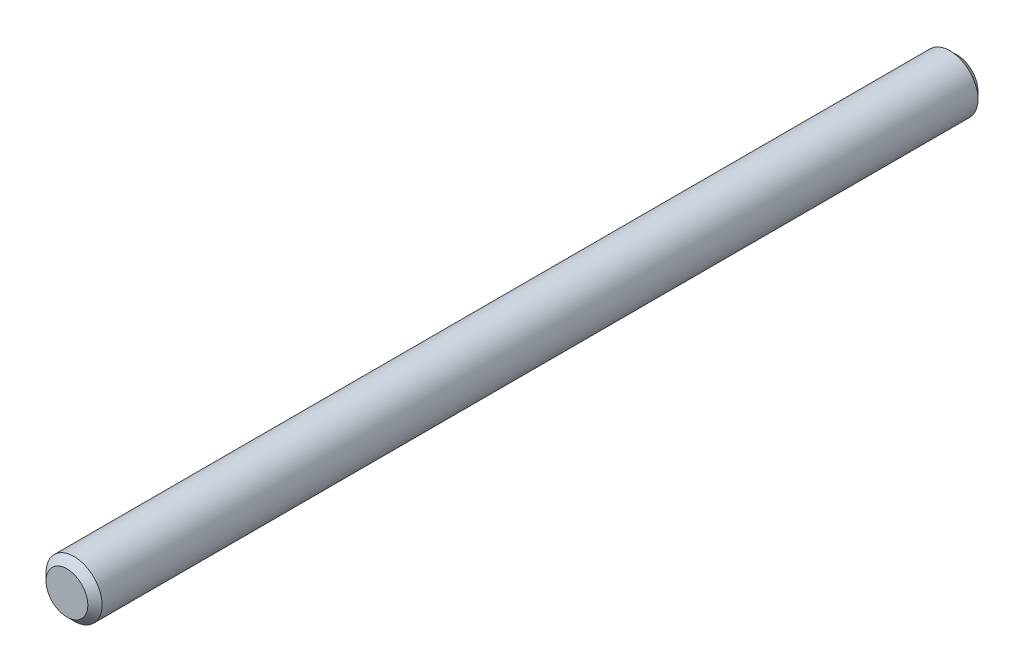
ISO-10303-21;
HEADER;
FILE_DESCRIPTION(('STEP AP214'),'2;1');
FILE_NAME('part.step','',(''),(''),'','','');
FILE_SCHEMA(('AUTOMOTIVE_DESIGN { 1 0 10303 214 1 1 1 1 }'));
ENDSEC;
DATA;
#1=APPLICATION_CONTEXT('core data for automotive mechanical design processes');
#2=APPLICATION_PROTOCOL_DEFINITION('international standard','automotive_design',2000,#1);
#3=PRODUCT_CONTEXT('',#1,'mechanical');
#4=PRODUCT('Part','Part','',(#3));
#5=PRODUCT_RELATED_PRODUCT_CATEGORY('part','',(#4));
#6=PRODUCT_DEFINITION_FORMATION('','',#4);
#7=PRODUCT_DEFINITION_CONTEXT('part definition',#1,'design');
#8=PRODUCT_DEFINITION('design','',#6,#7);
#9=PRODUCT_DEFINITION_SHAPE('','',#8);
#10=(LENGTH_UNIT() NAMED_UNIT(*) SI_UNIT(.MILLI.,.METRE.));
#11=(NAMED_UNIT(*) PLANE_ANGLE_UNIT() SI_UNIT($,.RADIAN.));
#12=(NAMED_UNIT(*) SI_UNIT($,.STERADIAN.) SOLID_ANGLE_UNIT());
#13=UNCERTAINTY_MEASURE_WITH_UNIT(LENGTH_MEASURE(1.E-05),#10,'distance_accuracy_value','');
#14=(GEOMETRIC_REPRESENTATION_CONTEXT(3) GLOBAL_UNCERTAINTY_ASSIGNED_CONTEXT((#13)) GLOBAL_UNIT_ASSIGNED_CONTEXT((#10,
#11,#12)) REPRESENTATION_CONTEXT('',''));
#15=CARTESIAN_POINT('',(0.,0.,0.));
#16=DIRECTION('',(0.,0.,1.));
#17=DIRECTION('',(1.,0.,0.));
#18=AXIS2_PLACEMENT_3D('',#15,#16,#17);
#19=CARTESIAN_POINT('',(0.,0.,63.5));
#20=DIRECTION('',(0.,0.,-1.));
#21=DIRECTION('',(-1.,0.,0.));
#22=AXIS2_PLACEMENT_3D('',#19,#20,#21);
#23=CYLINDRICAL_SURFACE('',#22,2.);
#24=CARTESIAN_POINT('',(0.,0.,0.507999999999995));
#25=DIRECTION('',(0.,0.,1.));
#26=DIRECTION('',(1.,0.,0.));
#27=AXIS2_PLACEMENT_3D('',#24,#25,#26);
#28=CIRCLE('',#27,2.);
#29=CARTESIAN_POINT('',(2.,0.,0.507999999999995));
#30=VERTEX_POINT('',#29);
#31=EDGE_CURVE('E41',#30,#30,#28,.T.);
#32=ORIENTED_EDGE('',*,*,#31,.T.);
#33=EDGE_LOOP('',(#32));
#34=FACE_BOUND('',#33,.T.);
#35=CARTESIAN_POINT('',(0.,0.,62.992));
#36=DIRECTION('',(0.,0.,1.));
#37=DIRECTION('',(1.,0.,0.));
#38=AXIS2_PLACEMENT_3D('',#35,#36,#37);
#39=CIRCLE('',#38,2.);
#40=CARTESIAN_POINT('',(2.,0.,62.992));
#41=VERTEX_POINT('',#40);
#42=EDGE_CURVE('E45',#41,#41,#39,.F.);
#43=ORIENTED_EDGE('',*,*,#42,.T.);
#44=EDGE_LOOP('',(#43));
#45=FACE_BOUND('',#44,.T.);
#46=ADVANCED_FACE('F30',(#34,#45),#23,.T.);
#47=CARTESIAN_POINT('',(0.,0.,63.5));
#48=DIRECTION('',(0.,0.,1.));
#49=DIRECTION('',(1.,0.,0.));
#50=AXIS2_PLACEMENT_3D('',#47,#48,#49);
#51=PLANE('',#50);
#52=CARTESIAN_POINT('',(0.,0.,63.5));
#53=DIRECTION('',(0.,0.,1.));
#54=DIRECTION('',(1.,0.,0.));
#55=AXIS2_PLACEMENT_3D('',#52,#53,#54);
#56=CIRCLE('',#55,1.492);
#57=CARTESIAN_POINT('',(1.492,0.,63.5));
#58=VERTEX_POINT('',#57);
#59=EDGE_CURVE('E10',#58,#58,#56,.T.);
#60=ORIENTED_EDGE('',*,*,#59,.T.);
#61=EDGE_LOOP('',(#60));
#62=FACE_BOUND('',#61,.T.);
#63=ADVANCED_FACE('F61',(#62),#51,.T.);
#64=CARTESIAN_POINT('',(0.,0.,0.));
#65=DIRECTION('',(0.,0.,1.));
#66=DIRECTION('',(1.,0.,0.));
#67=AXIS2_PLACEMENT_3D('',#64,#65,#66);
#68=PLANE('',#67);
#69=CARTESIAN_POINT('',(0.,0.,0.));
#70=DIRECTION('',(0.,0.,1.));
#71=DIRECTION('',(1.,0.,0.));
#72=AXIS2_PLACEMENT_3D('',#69,#70,#71);
#73=CIRCLE('',#72,1.492);
#74=CARTESIAN_POINT('',(1.492,0.,0.));
#75=VERTEX_POINT('',#74);
#76=EDGE_CURVE('E37',#75,#75,#73,.F.);
#77=ORIENTED_EDGE('',*,*,#76,.T.);
#78=EDGE_LOOP('',(#77));
#79=FACE_BOUND('',#78,.T.);
#80=ADVANCED_FACE('F58',(#79),#68,.F.);
#81=CARTESIAN_POINT('',(0.,0.,0.507999999999995));
#82=DIRECTION('',(0.,0.,1.));
#83=DIRECTION('',(1.,0.,0.));
#84=AXIS2_PLACEMENT_3D('',#81,#82,#83);
#85=CONICAL_SURFACE('',#84,2.,0.785398163397453);
#86=ORIENTED_EDGE('',*,*,#76,.F.);
#87=EDGE_LOOP('',(#86));
#88=FACE_BOUND('',#87,.T.);
#89=ORIENTED_EDGE('',*,*,#31,.F.);
#90=EDGE_LOOP('',(#89));
#91=FACE_BOUND('',#90,.T.);
#92=ADVANCED_FACE('F54',(#88,#91),#85,.T.);
#93=CARTESIAN_POINT('',(0.,0.,63.5));
#94=DIRECTION('',(0.,0.,-1.));
#95=DIRECTION('',(-1.,0.,0.));
#96=AXIS2_PLACEMENT_3D('',#93,#94,#95);
#97=CONICAL_SURFACE('',#96,1.492,0.785398163397467);
#98=ORIENTED_EDGE('',*,*,#42,.F.);
#99=EDGE_LOOP('',(#98));
#100=FACE_BOUND('',#99,.T.);
#101=ORIENTED_EDGE('',*,*,#59,.F.);
#102=EDGE_LOOP('',(#101));
#103=FACE_BOUND('',#102,.T.);
#104=ADVANCED_FACE('F32',(#100,#103),#97,.T.);
#105=CLOSED_SHELL('',(#46,#63,#80,#92,#104));
#106=MANIFOLD_SOLID_BREP('B2',#105);
#107=ADVANCED_BREP_SHAPE_REPRESENTATION('',(#18,#106),#14);
#108=SHAPE_DEFINITION_REPRESENTATION(#9,#107);
ENDSEC;
END-ISO-10303-21;
